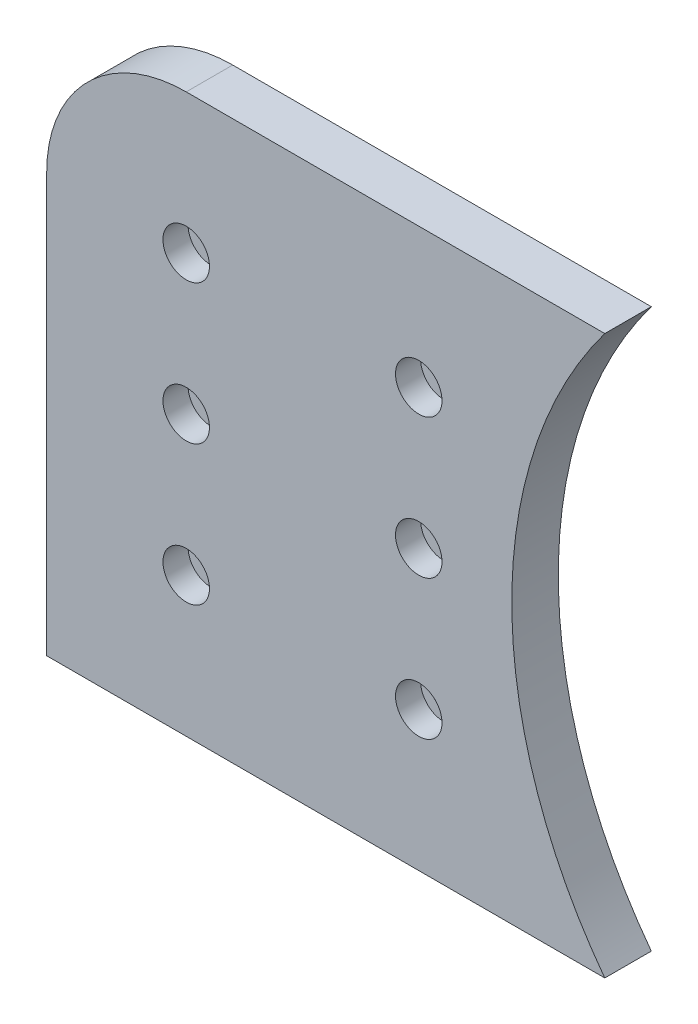
ISO-10303-21;
HEADER;
FILE_DESCRIPTION(('STEP AP214'),'2;1');
FILE_NAME('part.step','',(''),(''),'','','');
FILE_SCHEMA(('AUTOMOTIVE_DESIGN { 1 0 10303 214 1 1 1 1 }'));
ENDSEC;
DATA;
#1=APPLICATION_CONTEXT('core data for automotive mechanical design processes');
#2=APPLICATION_PROTOCOL_DEFINITION('international standard','automotive_design',2000,#1);
#3=PRODUCT_CONTEXT('',#1,'mechanical');
#4=PRODUCT('Part','Part','',(#3));
#5=PRODUCT_RELATED_PRODUCT_CATEGORY('part','',(#4));
#6=PRODUCT_DEFINITION_FORMATION('','',#4);
#7=PRODUCT_DEFINITION_CONTEXT('part definition',#1,'design');
#8=PRODUCT_DEFINITION('design','',#6,#7);
#9=PRODUCT_DEFINITION_SHAPE('','',#8);
#10=(LENGTH_UNIT() NAMED_UNIT(*) SI_UNIT(.MILLI.,.METRE.));
#11=(NAMED_UNIT(*) PLANE_ANGLE_UNIT() SI_UNIT($,.RADIAN.));
#12=(NAMED_UNIT(*) SI_UNIT($,.STERADIAN.) SOLID_ANGLE_UNIT());
#13=UNCERTAINTY_MEASURE_WITH_UNIT(LENGTH_MEASURE(1.E-05),#10,'distance_accuracy_value','');
#14=(GEOMETRIC_REPRESENTATION_CONTEXT(3) GLOBAL_UNCERTAINTY_ASSIGNED_CONTEXT((#13)) GLOBAL_UNIT_ASSIGNED_CONTEXT((#10,
#11,#12)) REPRESENTATION_CONTEXT('',''));
#15=CARTESIAN_POINT('',(0.,0.,0.));
#16=DIRECTION('',(0.,0.,1.));
#17=DIRECTION('',(1.,0.,0.));
#18=AXIS2_PLACEMENT_3D('',#15,#16,#17);
#19=CARTESIAN_POINT('',(200.,0.,5.));
#20=DIRECTION('',(0.,0.,-1.));
#21=DIRECTION('',(1.,0.,0.));
#22=AXIS2_PLACEMENT_3D('',#19,#20,#21);
#23=CYLINDRICAL_SURFACE('',#22,100.);
#24=CARTESIAN_POINT('',(200.,0.,-5.));
#25=DIRECTION('',(0.,0.,1.));
#26=DIRECTION('',(1.,0.,0.));
#27=AXIS2_PLACEMENT_3D('',#24,#25,#26);
#28=CIRCLE('',#27,100.);
#29=CARTESIAN_POINT('',(120.,60.,-5.));
#30=VERTEX_POINT('',#29);
#31=CARTESIAN_POINT('',(120.,-60.,-5.));
#32=VERTEX_POINT('',#31);
#33=EDGE_CURVE('E115',#30,#32,#28,.T.);
#34=ORIENTED_EDGE('',*,*,#33,.F.);
#35=DIRECTION('',(0.,0.,-1.));
#36=VECTOR('',#35,1.);
#37=CARTESIAN_POINT('',(120.,60.,5.));
#38=LINE('',#37,#36);
#39=CARTESIAN_POINT('',(120.,60.,5.));
#40=VERTEX_POINT('',#39);
#41=EDGE_CURVE('E103',#40,#30,#38,.T.);
#42=ORIENTED_EDGE('',*,*,#41,.F.);
#43=CARTESIAN_POINT('',(200.,0.,5.));
#44=DIRECTION('',(0.,0.,1.));
#45=DIRECTION('',(1.,0.,0.));
#46=AXIS2_PLACEMENT_3D('',#43,#44,#45);
#47=CIRCLE('',#46,100.);
#48=CARTESIAN_POINT('',(120.,-60.,5.));
#49=VERTEX_POINT('',#48);
#50=EDGE_CURVE('E83',#40,#49,#47,.T.);
#51=ORIENTED_EDGE('',*,*,#50,.T.);
#52=DIRECTION('',(0.,0.,-1.));
#53=VECTOR('',#52,1.);
#54=CARTESIAN_POINT('',(120.,-60.,5.));
#55=LINE('',#54,#53);
#56=EDGE_CURVE('E92',#49,#32,#55,.T.);
#57=ORIENTED_EDGE('',*,*,#56,.T.);
#58=EDGE_LOOP('',(#34,#42,#51,#57));
#59=FACE_BOUND('',#58,.T.);
#60=ADVANCED_FACE('F32',(#59),#23,.F.);
#61=CARTESIAN_POINT('',(120.,-60.,5.));
#62=DIRECTION('',(0.,1.,0.));
#63=DIRECTION('',(0.,0.,1.));
#64=AXIS2_PLACEMENT_3D('',#61,#62,#63);
#65=PLANE('',#64);
#66=DIRECTION('',(-1.,0.,0.));
#67=VECTOR('',#66,1.);
#68=CARTESIAN_POINT('',(120.,-60.,-5.));
#69=LINE('',#68,#67);
#70=CARTESIAN_POINT('',(0.,-60.,-5.));
#71=VERTEX_POINT('',#70);
#72=EDGE_CURVE('E95',#32,#71,#69,.T.);
#73=ORIENTED_EDGE('',*,*,#72,.F.);
#74=ORIENTED_EDGE('',*,*,#56,.F.);
#75=DIRECTION('',(-1.,0.,0.));
#76=VECTOR('',#75,1.);
#77=CARTESIAN_POINT('',(120.,-60.,5.));
#78=LINE('',#77,#76);
#79=CARTESIAN_POINT('',(0.,-60.,5.));
#80=VERTEX_POINT('',#79);
#81=EDGE_CURVE('E78',#49,#80,#78,.T.);
#82=ORIENTED_EDGE('',*,*,#81,.T.);
#83=DIRECTION('',(0.,0.,-1.));
#84=VECTOR('',#83,1.);
#85=CARTESIAN_POINT('',(0.,-60.,5.));
#86=LINE('',#85,#84);
#87=EDGE_CURVE('E100',#80,#71,#86,.T.);
#88=ORIENTED_EDGE('',*,*,#87,.T.);
#89=EDGE_LOOP('',(#73,#74,#82,#88));
#90=FACE_BOUND('',#89,.T.);
#91=ADVANCED_FACE('F93',(#90),#65,.F.);
#92=CARTESIAN_POINT('',(0.,60.,5.));
#93=DIRECTION('',(1.,0.,0.));
#94=DIRECTION('',(0.,0.,1.));
#95=AXIS2_PLACEMENT_3D('',#92,#93,#94);
#96=PLANE('',#95);
#97=DIRECTION('',(0.,1.,0.));
#98=VECTOR('',#97,1.);
#99=CARTESIAN_POINT('',(0.,60.,-5.));
#100=LINE('',#99,#98);
#101=CARTESIAN_POINT('',(0.,30.,-5.));
#102=VERTEX_POINT('',#101);
#103=EDGE_CURVE('E106',#71,#102,#100,.T.);
#104=ORIENTED_EDGE('',*,*,#103,.F.);
#105=ORIENTED_EDGE('',*,*,#87,.F.);
#106=DIRECTION('',(0.,1.,0.));
#107=VECTOR('',#106,1.);
#108=CARTESIAN_POINT('',(0.,60.,5.));
#109=LINE('',#108,#107);
#110=CARTESIAN_POINT('',(0.,30.,5.));
#111=VERTEX_POINT('',#110);
#112=EDGE_CURVE('E86',#80,#111,#109,.T.);
#113=ORIENTED_EDGE('',*,*,#112,.T.);
#114=DIRECTION('',(0.,0.,-1.));
#115=VECTOR('',#114,1.);
#116=CARTESIAN_POINT('',(0.,30.,5.));
#117=LINE('',#116,#115);
#118=EDGE_CURVE('E124',#102,#111,#117,.F.);
#119=ORIENTED_EDGE('',*,*,#118,.F.);
#120=EDGE_LOOP('',(#104,#105,#113,#119));
#121=FACE_BOUND('',#120,.T.);
#122=ADVANCED_FACE('F187',(#121),#96,.F.);
#123=CARTESIAN_POINT('',(120.,60.,5.));
#124=DIRECTION('',(0.,-1.,0.));
#125=DIRECTION('',(0.,0.,-1.));
#126=AXIS2_PLACEMENT_3D('',#123,#124,#125);
#127=PLANE('',#126);
#128=DIRECTION('',(1.,0.,0.));
#129=VECTOR('',#128,1.);
#130=CARTESIAN_POINT('',(120.,60.,5.));
#131=LINE('',#130,#129);
#132=CARTESIAN_POINT('',(30.,60.,5.));
#133=VERTEX_POINT('',#132);
#134=EDGE_CURVE('E113',#133,#40,#131,.T.);
#135=ORIENTED_EDGE('',*,*,#134,.T.);
#136=ORIENTED_EDGE('',*,*,#41,.T.);
#137=DIRECTION('',(1.,0.,0.));
#138=VECTOR('',#137,1.);
#139=CARTESIAN_POINT('',(120.,60.,-5.));
#140=LINE('',#139,#138);
#141=CARTESIAN_POINT('',(30.,60.,-5.));
#142=VERTEX_POINT('',#141);
#143=EDGE_CURVE('E104',#142,#30,#140,.T.);
#144=ORIENTED_EDGE('',*,*,#143,.F.);
#145=DIRECTION('',(0.,0.,-1.));
#146=VECTOR('',#145,1.);
#147=CARTESIAN_POINT('',(30.,60.,5.));
#148=LINE('',#147,#146);
#149=EDGE_CURVE('E99',#133,#142,#148,.T.);
#150=ORIENTED_EDGE('',*,*,#149,.F.);
#151=EDGE_LOOP('',(#135,#136,#144,#150));
#152=FACE_BOUND('',#151,.T.);
#153=ADVANCED_FACE('F239',(#152),#127,.F.);
#154=CARTESIAN_POINT('',(200.,0.,5.));
#155=DIRECTION('',(0.,0.,-1.));
#156=DIRECTION('',(1.,0.,0.));
#157=AXIS2_PLACEMENT_3D('',#154,#155,#156);
#158=PLANE('',#157);
#159=CARTESIAN_POINT('',(30.,0.,5.));
#160=DIRECTION('',(0.,0.,-1.));
#161=DIRECTION('',(-1.,0.,0.));
#162=AXIS2_PLACEMENT_3D('',#159,#160,#161);
#163=CIRCLE('',#162,5.);
#164=CARTESIAN_POINT('',(25.,0.,5.));
#165=VERTEX_POINT('',#164);
#166=EDGE_CURVE('E470',#165,#165,#163,.T.);
#167=ORIENTED_EDGE('',*,*,#166,.T.);
#168=EDGE_LOOP('',(#167));
#169=FACE_BOUND('',#168,.T.);
#170=CARTESIAN_POINT('',(30.,30.,5.));
#171=DIRECTION('',(0.,0.,-1.));
#172=DIRECTION('',(-1.,0.,0.));
#173=AXIS2_PLACEMENT_3D('',#170,#171,#172);
#174=CIRCLE('',#173,5.);
#175=CARTESIAN_POINT('',(25.,30.,5.));
#176=VERTEX_POINT('',#175);
#177=EDGE_CURVE('E458',#176,#176,#174,.T.);
#178=ORIENTED_EDGE('',*,*,#177,.T.);
#179=EDGE_LOOP('',(#178));
#180=FACE_BOUND('',#179,.T.);
#181=ORIENTED_EDGE('',*,*,#112,.F.);
#182=ORIENTED_EDGE('',*,*,#81,.F.);
#183=ORIENTED_EDGE('',*,*,#50,.F.);
#184=ORIENTED_EDGE('',*,*,#134,.F.);
#185=CARTESIAN_POINT('',(30.,30.,5.));
#186=DIRECTION('',(0.,0.,1.));
#187=DIRECTION('',(1.,0.,0.));
#188=AXIS2_PLACEMENT_3D('',#185,#186,#187);
#189=CIRCLE('',#188,30.);
#190=EDGE_CURVE('E47',#111,#133,#189,.F.);
#191=ORIENTED_EDGE('',*,*,#190,.F.);
#192=EDGE_LOOP('',(#181,#182,#183,#184,#191));
#193=FACE_BOUND('',#192,.T.);
#194=CARTESIAN_POINT('',(30.,-30.,5.));
#195=DIRECTION('',(0.,0.,-1.));
#196=DIRECTION('',(-1.,0.,0.));
#197=AXIS2_PLACEMENT_3D('',#194,#195,#196);
#198=CIRCLE('',#197,5.);
#199=CARTESIAN_POINT('',(25.,-30.,5.));
#200=VERTEX_POINT('',#199);
#201=EDGE_CURVE('E127',#200,#200,#198,.T.);
#202=ORIENTED_EDGE('',*,*,#201,.T.);
#203=EDGE_LOOP('',(#202));
#204=FACE_BOUND('',#203,.T.);
#205=CARTESIAN_POINT('',(80.,30.,5.));
#206=DIRECTION('',(0.,0.,-1.));
#207=DIRECTION('',(-1.,0.,0.));
#208=AXIS2_PLACEMENT_3D('',#205,#206,#207);
#209=CIRCLE('',#208,5.);
#210=CARTESIAN_POINT('',(75.,30.,5.));
#211=VERTEX_POINT('',#210);
#212=EDGE_CURVE('E139',#211,#211,#209,.T.);
#213=ORIENTED_EDGE('',*,*,#212,.T.);
#214=EDGE_LOOP('',(#213));
#215=FACE_BOUND('',#214,.T.);
#216=CARTESIAN_POINT('',(80.,0.,5.));
#217=DIRECTION('',(0.,0.,-1.));
#218=DIRECTION('',(-1.,0.,0.));
#219=AXIS2_PLACEMENT_3D('',#216,#217,#218);
#220=CIRCLE('',#219,5.);
#221=CARTESIAN_POINT('',(75.,0.,5.));
#222=VERTEX_POINT('',#221);
#223=EDGE_CURVE('E151',#222,#222,#220,.T.);
#224=ORIENTED_EDGE('',*,*,#223,.T.);
#225=EDGE_LOOP('',(#224));
#226=FACE_BOUND('',#225,.T.);
#227=CARTESIAN_POINT('',(80.,-30.,5.));
#228=DIRECTION('',(0.,0.,-1.));
#229=DIRECTION('',(-1.,0.,0.));
#230=AXIS2_PLACEMENT_3D('',#227,#228,#229);
#231=CIRCLE('',#230,5.);
#232=CARTESIAN_POINT('',(75.,-30.,5.));
#233=VERTEX_POINT('',#232);
#234=EDGE_CURVE('E163',#233,#233,#231,.T.);
#235=ORIENTED_EDGE('',*,*,#234,.T.);
#236=EDGE_LOOP('',(#235));
#237=FACE_BOUND('',#236,.T.);
#238=ADVANCED_FACE('F80',(#169,#180,#193,#204,#215,#226,#237),#158,.F.);
#239=CARTESIAN_POINT('',(200.,0.,-5.));
#240=DIRECTION('',(0.,0.,-1.));
#241=DIRECTION('',(1.,0.,0.));
#242=AXIS2_PLACEMENT_3D('',#239,#240,#241);
#243=PLANE('',#242);
#244=CARTESIAN_POINT('',(30.,0.,-5.));
#245=DIRECTION('',(0.,0.,-1.));
#246=DIRECTION('',(-1.,0.,0.));
#247=AXIS2_PLACEMENT_3D('',#244,#245,#246);
#248=CIRCLE('',#247,2.65);
#249=CARTESIAN_POINT('',(27.35,0.,-5.));
#250=VERTEX_POINT('',#249);
#251=EDGE_CURVE('E450',#250,#250,#248,.T.);
#252=ORIENTED_EDGE('',*,*,#251,.F.);
#253=EDGE_LOOP('',(#252));
#254=FACE_BOUND('',#253,.T.);
#255=CARTESIAN_POINT('',(30.,30.,-5.));
#256=DIRECTION('',(0.,0.,-1.));
#257=DIRECTION('',(-1.,0.,0.));
#258=AXIS2_PLACEMENT_3D('',#255,#256,#257);
#259=CIRCLE('',#258,2.65);
#260=CARTESIAN_POINT('',(27.35,30.,-5.));
#261=VERTEX_POINT('',#260);
#262=EDGE_CURVE('E109',#261,#261,#259,.T.);
#263=ORIENTED_EDGE('',*,*,#262,.F.);
#264=EDGE_LOOP('',(#263));
#265=FACE_BOUND('',#264,.T.);
#266=ORIENTED_EDGE('',*,*,#143,.T.);
#267=ORIENTED_EDGE('',*,*,#33,.T.);
#268=ORIENTED_EDGE('',*,*,#72,.T.);
#269=ORIENTED_EDGE('',*,*,#103,.T.);
#270=CARTESIAN_POINT('',(30.,30.,-5.));
#271=DIRECTION('',(0.,0.,1.));
#272=DIRECTION('',(1.,0.,0.));
#273=AXIS2_PLACEMENT_3D('',#270,#271,#272);
#274=CIRCLE('',#273,30.);
#275=EDGE_CURVE('E54',#142,#102,#274,.T.);
#276=ORIENTED_EDGE('',*,*,#275,.F.);
#277=EDGE_LOOP('',(#266,#267,#268,#269,#276));
#278=FACE_BOUND('',#277,.T.);
#279=CARTESIAN_POINT('',(30.,-30.,-5.));
#280=DIRECTION('',(0.,0.,-1.));
#281=DIRECTION('',(-1.,0.,0.));
#282=AXIS2_PLACEMENT_3D('',#279,#280,#281);
#283=CIRCLE('',#282,2.65);
#284=CARTESIAN_POINT('',(27.35,-30.,-5.));
#285=VERTEX_POINT('',#284);
#286=EDGE_CURVE('E130',#285,#285,#283,.T.);
#287=ORIENTED_EDGE('',*,*,#286,.F.);
#288=EDGE_LOOP('',(#287));
#289=FACE_BOUND('',#288,.T.);
#290=CARTESIAN_POINT('',(80.,30.,-5.));
#291=DIRECTION('',(0.,0.,-1.));
#292=DIRECTION('',(-1.,0.,0.));
#293=AXIS2_PLACEMENT_3D('',#290,#291,#292);
#294=CIRCLE('',#293,2.65);
#295=CARTESIAN_POINT('',(77.35,30.,-5.));
#296=VERTEX_POINT('',#295);
#297=EDGE_CURVE('E142',#296,#296,#294,.T.);
#298=ORIENTED_EDGE('',*,*,#297,.F.);
#299=EDGE_LOOP('',(#298));
#300=FACE_BOUND('',#299,.T.);
#301=CARTESIAN_POINT('',(80.,0.,-5.));
#302=DIRECTION('',(0.,0.,-1.));
#303=DIRECTION('',(-1.,0.,0.));
#304=AXIS2_PLACEMENT_3D('',#301,#302,#303);
#305=CIRCLE('',#304,2.65);
#306=CARTESIAN_POINT('',(77.35,0.,-5.));
#307=VERTEX_POINT('',#306);
#308=EDGE_CURVE('E154',#307,#307,#305,.T.);
#309=ORIENTED_EDGE('',*,*,#308,.F.);
#310=EDGE_LOOP('',(#309));
#311=FACE_BOUND('',#310,.T.);
#312=CARTESIAN_POINT('',(80.,-30.,-5.));
#313=DIRECTION('',(0.,0.,-1.));
#314=DIRECTION('',(-1.,0.,0.));
#315=AXIS2_PLACEMENT_3D('',#312,#313,#314);
#316=CIRCLE('',#315,2.65);
#317=CARTESIAN_POINT('',(77.35,-30.,-5.));
#318=VERTEX_POINT('',#317);
#319=EDGE_CURVE('E166',#318,#318,#316,.T.);
#320=ORIENTED_EDGE('',*,*,#319,.F.);
#321=EDGE_LOOP('',(#320));
#322=FACE_BOUND('',#321,.T.);
#323=ADVANCED_FACE('F195',(#254,#265,#278,#289,#300,#311,#322),#243,.T.);
#324=CARTESIAN_POINT('',(30.,30.,5.));
#325=DIRECTION('',(0.,0.,-1.));
#326=DIRECTION('',(1.,0.,0.));
#327=AXIS2_PLACEMENT_3D('',#324,#325,#326);
#328=CYLINDRICAL_SURFACE('',#327,30.);
#329=ORIENTED_EDGE('',*,*,#190,.T.);
#330=ORIENTED_EDGE('',*,*,#149,.T.);
#331=ORIENTED_EDGE('',*,*,#275,.T.);
#332=ORIENTED_EDGE('',*,*,#118,.T.);
#333=EDGE_LOOP('',(#329,#330,#331,#332));
#334=FACE_BOUND('',#333,.T.);
#335=ADVANCED_FACE('F191',(#334),#328,.T.);
#336=CARTESIAN_POINT('',(30.,30.,5.));
#337=DIRECTION('',(0.,0.,1.));
#338=DIRECTION('',(-1.,0.,0.));
#339=AXIS2_PLACEMENT_3D('',#336,#337,#338);
#340=CYLINDRICAL_SURFACE('',#339,2.65);
#341=ORIENTED_EDGE('',*,*,#262,.T.);
#342=EDGE_LOOP('',(#341));
#343=FACE_BOUND('',#342,.T.);
#344=CARTESIAN_POINT('',(30.,30.,-0.4));
#345=DIRECTION('',(0.,0.,-1.));
#346=DIRECTION('',(-1.,0.,0.));
#347=AXIS2_PLACEMENT_3D('',#344,#345,#346);
#348=CIRCLE('',#347,2.65);
#349=CARTESIAN_POINT('',(27.35,30.,-0.4));
#350=VERTEX_POINT('',#349);
#351=EDGE_CURVE('E453',#350,#350,#348,.T.);
#352=ORIENTED_EDGE('',*,*,#351,.F.);
#353=EDGE_LOOP('',(#352));
#354=FACE_BOUND('',#353,.T.);
#355=ADVANCED_FACE('F194',(#343,#354),#340,.F.);
#356=CARTESIAN_POINT('',(27.35,30.,-0.4));
#357=DIRECTION('',(0.,0.,-1.));
#358=DIRECTION('',(1.,0.,0.));
#359=AXIS2_PLACEMENT_3D('',#356,#357,#358);
#360=PLANE('',#359);
#361=ORIENTED_EDGE('',*,*,#351,.T.);
#362=EDGE_LOOP('',(#361));
#363=FACE_BOUND('',#362,.T.);
#364=CARTESIAN_POINT('',(30.,30.,-0.4));
#365=DIRECTION('',(0.,0.,-1.));
#366=DIRECTION('',(-1.,0.,0.));
#367=AXIS2_PLACEMENT_3D('',#364,#365,#366);
#368=CIRCLE('',#367,5.);
#369=CARTESIAN_POINT('',(25.,30.,-0.4));
#370=VERTEX_POINT('',#369);
#371=EDGE_CURVE('E455',#370,#370,#368,.T.);
#372=ORIENTED_EDGE('',*,*,#371,.F.);
#373=EDGE_LOOP('',(#372));
#374=FACE_BOUND('',#373,.T.);
#375=ADVANCED_FACE('F341',(#363,#374),#360,.F.);
#376=CARTESIAN_POINT('',(30.,30.,5.));
#377=DIRECTION('',(0.,0.,1.));
#378=DIRECTION('',(-1.,0.,0.));
#379=AXIS2_PLACEMENT_3D('',#376,#377,#378);
#380=CYLINDRICAL_SURFACE('',#379,5.);
#381=ORIENTED_EDGE('',*,*,#371,.T.);
#382=EDGE_LOOP('',(#381));
#383=FACE_BOUND('',#382,.T.);
#384=ORIENTED_EDGE('',*,*,#177,.F.);
#385=EDGE_LOOP('',(#384));
#386=FACE_BOUND('',#385,.T.);
#387=ADVANCED_FACE('F332',(#383,#386),#380,.F.);
#388=CARTESIAN_POINT('',(30.,0.,5.));
#389=DIRECTION('',(0.,0.,1.));
#390=DIRECTION('',(-1.,0.,0.));
#391=AXIS2_PLACEMENT_3D('',#388,#389,#390);
#392=CYLINDRICAL_SURFACE('',#391,2.65);
#393=ORIENTED_EDGE('',*,*,#251,.T.);
#394=EDGE_LOOP('',(#393));
#395=FACE_BOUND('',#394,.T.);
#396=CARTESIAN_POINT('',(30.,0.,-0.4));
#397=DIRECTION('',(0.,0.,-1.));
#398=DIRECTION('',(-1.,0.,0.));
#399=AXIS2_PLACEMENT_3D('',#396,#397,#398);
#400=CIRCLE('',#399,2.65);
#401=CARTESIAN_POINT('',(27.35,0.,-0.4));
#402=VERTEX_POINT('',#401);
#403=EDGE_CURVE('E463',#402,#402,#400,.T.);
#404=ORIENTED_EDGE('',*,*,#403,.F.);
#405=EDGE_LOOP('',(#404));
#406=FACE_BOUND('',#405,.T.);
#407=ADVANCED_FACE('F323',(#395,#406),#392,.F.);
#408=CARTESIAN_POINT('',(27.35,0.,-0.4));
#409=DIRECTION('',(0.,0.,-1.));
#410=DIRECTION('',(1.,0.,0.));
#411=AXIS2_PLACEMENT_3D('',#408,#409,#410);
#412=PLANE('',#411);
#413=ORIENTED_EDGE('',*,*,#403,.T.);
#414=EDGE_LOOP('',(#413));
#415=FACE_BOUND('',#414,.T.);
#416=CARTESIAN_POINT('',(30.,0.,-0.4));
#417=DIRECTION('',(0.,0.,-1.));
#418=DIRECTION('',(-1.,0.,0.));
#419=AXIS2_PLACEMENT_3D('',#416,#417,#418);
#420=CIRCLE('',#419,5.);
#421=CARTESIAN_POINT('',(25.,0.,-0.4));
#422=VERTEX_POINT('',#421);
#423=EDGE_CURVE('E466',#422,#422,#420,.T.);
#424=ORIENTED_EDGE('',*,*,#423,.F.);
#425=EDGE_LOOP('',(#424));
#426=FACE_BOUND('',#425,.T.);
#427=ADVANCED_FACE('F314',(#415,#426),#412,.F.);
#428=CARTESIAN_POINT('',(30.,0.,5.));
#429=DIRECTION('',(0.,0.,1.));
#430=DIRECTION('',(-1.,0.,0.));
#431=AXIS2_PLACEMENT_3D('',#428,#429,#430);
#432=CYLINDRICAL_SURFACE('',#431,5.);
#433=ORIENTED_EDGE('',*,*,#423,.T.);
#434=EDGE_LOOP('',(#433));
#435=FACE_BOUND('',#434,.T.);
#436=ORIENTED_EDGE('',*,*,#166,.F.);
#437=EDGE_LOOP('',(#436));
#438=FACE_BOUND('',#437,.T.);
#439=ADVANCED_FACE('F208',(#435,#438),#432,.F.);
#440=CARTESIAN_POINT('',(30.,-30.,5.));
#441=DIRECTION('',(0.,0.,1.));
#442=DIRECTION('',(-1.,0.,0.));
#443=AXIS2_PLACEMENT_3D('',#440,#441,#442);
#444=CYLINDRICAL_SURFACE('',#443,5.);
#445=CARTESIAN_POINT('',(30.,-30.,-0.4));
#446=DIRECTION('',(0.,0.,-1.));
#447=DIRECTION('',(-1.,0.,0.));
#448=AXIS2_PLACEMENT_3D('',#445,#446,#447);
#449=CIRCLE('',#448,5.);
#450=CARTESIAN_POINT('',(25.,-30.,-0.4));
#451=VERTEX_POINT('',#450);
#452=EDGE_CURVE('E136',#451,#451,#449,.T.);
#453=ORIENTED_EDGE('',*,*,#452,.T.);
#454=EDGE_LOOP('',(#453));
#455=FACE_BOUND('',#454,.T.);
#456=ORIENTED_EDGE('',*,*,#201,.F.);
#457=EDGE_LOOP('',(#456));
#458=FACE_BOUND('',#457,.T.);
#459=ADVANCED_FACE('F204',(#455,#458),#444,.F.);
#460=CARTESIAN_POINT('',(27.35,-30.,-0.4));
#461=DIRECTION('',(0.,0.,-1.));
#462=DIRECTION('',(1.,0.,0.));
#463=AXIS2_PLACEMENT_3D('',#460,#461,#462);
#464=PLANE('',#463);
#465=CARTESIAN_POINT('',(30.,-30.,-0.4));
#466=DIRECTION('',(0.,0.,-1.));
#467=DIRECTION('',(-1.,0.,0.));
#468=AXIS2_PLACEMENT_3D('',#465,#466,#467);
#469=CIRCLE('',#468,2.65);
#470=CARTESIAN_POINT('',(27.35,-30.,-0.4));
#471=VERTEX_POINT('',#470);
#472=EDGE_CURVE('E133',#471,#471,#469,.T.);
#473=ORIENTED_EDGE('',*,*,#472,.T.);
#474=EDGE_LOOP('',(#473));
#475=FACE_BOUND('',#474,.T.);
#476=ORIENTED_EDGE('',*,*,#452,.F.);
#477=EDGE_LOOP('',(#476));
#478=FACE_BOUND('',#477,.T.);
#479=ADVANCED_FACE('F200',(#475,#478),#464,.F.);
#480=CARTESIAN_POINT('',(30.,-30.,5.));
#481=DIRECTION('',(0.,0.,1.));
#482=DIRECTION('',(-1.,0.,0.));
#483=AXIS2_PLACEMENT_3D('',#480,#481,#482);
#484=CYLINDRICAL_SURFACE('',#483,2.65);
#485=ORIENTED_EDGE('',*,*,#286,.T.);
#486=EDGE_LOOP('',(#485));
#487=FACE_BOUND('',#486,.T.);
#488=ORIENTED_EDGE('',*,*,#472,.F.);
#489=EDGE_LOOP('',(#488));
#490=FACE_BOUND('',#489,.T.);
#491=ADVANCED_FACE('F196',(#487,#490),#484,.F.);
#492=CARTESIAN_POINT('',(80.,30.,5.));
#493=DIRECTION('',(0.,0.,1.));
#494=DIRECTION('',(-1.,0.,0.));
#495=AXIS2_PLACEMENT_3D('',#492,#493,#494);
#496=CYLINDRICAL_SURFACE('',#495,5.);
#497=CARTESIAN_POINT('',(80.,30.,-0.4));
#498=DIRECTION('',(0.,0.,-1.));
#499=DIRECTION('',(-1.,0.,0.));
#500=AXIS2_PLACEMENT_3D('',#497,#498,#499);
#501=CIRCLE('',#500,5.);
#502=CARTESIAN_POINT('',(75.,30.,-0.4));
#503=VERTEX_POINT('',#502);
#504=EDGE_CURVE('E148',#503,#503,#501,.T.);
#505=ORIENTED_EDGE('',*,*,#504,.T.);
#506=EDGE_LOOP('',(#505));
#507=FACE_BOUND('',#506,.T.);
#508=ORIENTED_EDGE('',*,*,#212,.F.);
#509=EDGE_LOOP('',(#508));
#510=FACE_BOUND('',#509,.T.);
#511=ADVANCED_FACE('F199',(#507,#510),#496,.F.);
#512=CARTESIAN_POINT('',(77.35,30.,-0.4));
#513=DIRECTION('',(0.,0.,-1.));
#514=DIRECTION('',(1.,0.,0.));
#515=AXIS2_PLACEMENT_3D('',#512,#513,#514);
#516=PLANE('',#515);
#517=CARTESIAN_POINT('',(80.,30.,-0.4));
#518=DIRECTION('',(0.,0.,-1.));
#519=DIRECTION('',(-1.,0.,0.));
#520=AXIS2_PLACEMENT_3D('',#517,#518,#519);
#521=CIRCLE('',#520,2.65);
#522=CARTESIAN_POINT('',(77.35,30.,-0.4));
#523=VERTEX_POINT('',#522);
#524=EDGE_CURVE('E145',#523,#523,#521,.T.);
#525=ORIENTED_EDGE('',*,*,#524,.T.);
#526=EDGE_LOOP('',(#525));
#527=FACE_BOUND('',#526,.T.);
#528=ORIENTED_EDGE('',*,*,#504,.F.);
#529=EDGE_LOOP('',(#528));
#530=FACE_BOUND('',#529,.T.);
#531=ADVANCED_FACE('F214',(#527,#530),#516,.F.);
#532=CARTESIAN_POINT('',(80.,30.,5.));
#533=DIRECTION('',(0.,0.,1.));
#534=DIRECTION('',(-1.,0.,0.));
#535=AXIS2_PLACEMENT_3D('',#532,#533,#534);
#536=CYLINDRICAL_SURFACE('',#535,2.65);
#537=ORIENTED_EDGE('',*,*,#297,.T.);
#538=EDGE_LOOP('',(#537));
#539=FACE_BOUND('',#538,.T.);
#540=ORIENTED_EDGE('',*,*,#524,.F.);
#541=EDGE_LOOP('',(#540));
#542=FACE_BOUND('',#541,.T.);
#543=ADVANCED_FACE('F210',(#539,#542),#536,.F.);
#544=CARTESIAN_POINT('',(80.,0.,5.));
#545=DIRECTION('',(0.,0.,1.));
#546=DIRECTION('',(-1.,0.,0.));
#547=AXIS2_PLACEMENT_3D('',#544,#545,#546);
#548=CYLINDRICAL_SURFACE('',#547,5.);
#549=CARTESIAN_POINT('',(80.,0.,-0.4));
#550=DIRECTION('',(0.,0.,-1.));
#551=DIRECTION('',(-1.,0.,0.));
#552=AXIS2_PLACEMENT_3D('',#549,#550,#551);
#553=CIRCLE('',#552,5.);
#554=CARTESIAN_POINT('',(75.,0.,-0.4));
#555=VERTEX_POINT('',#554);
#556=EDGE_CURVE('E160',#555,#555,#553,.T.);
#557=ORIENTED_EDGE('',*,*,#556,.T.);
#558=EDGE_LOOP('',(#557));
#559=FACE_BOUND('',#558,.T.);
#560=ORIENTED_EDGE('',*,*,#223,.F.);
#561=EDGE_LOOP('',(#560));
#562=FACE_BOUND('',#561,.T.);
#563=ADVANCED_FACE('F213',(#559,#562),#548,.F.);
#564=CARTESIAN_POINT('',(77.35,0.,-0.4));
#565=DIRECTION('',(0.,0.,-1.));
#566=DIRECTION('',(1.,0.,0.));
#567=AXIS2_PLACEMENT_3D('',#564,#565,#566);
#568=PLANE('',#567);
#569=CARTESIAN_POINT('',(80.,0.,-0.4));
#570=DIRECTION('',(0.,0.,-1.));
#571=DIRECTION('',(-1.,0.,0.));
#572=AXIS2_PLACEMENT_3D('',#569,#570,#571);
#573=CIRCLE('',#572,2.65);
#574=CARTESIAN_POINT('',(77.35,0.,-0.4));
#575=VERTEX_POINT('',#574);
#576=EDGE_CURVE('E157',#575,#575,#573,.T.);
#577=ORIENTED_EDGE('',*,*,#576,.T.);
#578=EDGE_LOOP('',(#577));
#579=FACE_BOUND('',#578,.T.);
#580=ORIENTED_EDGE('',*,*,#556,.F.);
#581=EDGE_LOOP('',(#580));
#582=FACE_BOUND('',#581,.T.);
#583=ADVANCED_FACE('F225',(#579,#582),#568,.F.);
#584=CARTESIAN_POINT('',(80.,0.,5.));
#585=DIRECTION('',(0.,0.,1.));
#586=DIRECTION('',(-1.,0.,0.));
#587=AXIS2_PLACEMENT_3D('',#584,#585,#586);
#588=CYLINDRICAL_SURFACE('',#587,2.65);
#589=ORIENTED_EDGE('',*,*,#308,.T.);
#590=EDGE_LOOP('',(#589));
#591=FACE_BOUND('',#590,.T.);
#592=ORIENTED_EDGE('',*,*,#576,.F.);
#593=EDGE_LOOP('',(#592));
#594=FACE_BOUND('',#593,.T.);
#595=ADVANCED_FACE('F222',(#591,#594),#588,.F.);
#596=CARTESIAN_POINT('',(80.,-30.,5.));
#597=DIRECTION('',(0.,0.,1.));
#598=DIRECTION('',(-1.,0.,0.));
#599=AXIS2_PLACEMENT_3D('',#596,#597,#598);
#600=CYLINDRICAL_SURFACE('',#599,5.);
#601=CARTESIAN_POINT('',(80.,-30.,-0.4));
#602=DIRECTION('',(0.,0.,-1.));
#603=DIRECTION('',(-1.,0.,0.));
#604=AXIS2_PLACEMENT_3D('',#601,#602,#603);
#605=CIRCLE('',#604,5.);
#606=CARTESIAN_POINT('',(75.,-30.,-0.4));
#607=VERTEX_POINT('',#606);
#608=EDGE_CURVE('E11',#607,#607,#605,.T.);
#609=ORIENTED_EDGE('',*,*,#608,.T.);
#610=EDGE_LOOP('',(#609));
#611=FACE_BOUND('',#610,.T.);
#612=ORIENTED_EDGE('',*,*,#234,.F.);
#613=EDGE_LOOP('',(#612));
#614=FACE_BOUND('',#613,.T.);
#615=ADVANCED_FACE('F34',(#611,#614),#600,.F.);
#616=CARTESIAN_POINT('',(77.35,-30.,-0.4));
#617=DIRECTION('',(0.,0.,-1.));
#618=DIRECTION('',(1.,0.,0.));
#619=AXIS2_PLACEMENT_3D('',#616,#617,#618);
#620=PLANE('',#619);
#621=CARTESIAN_POINT('',(80.,-30.,-0.4));
#622=DIRECTION('',(0.,0.,-1.));
#623=DIRECTION('',(-1.,0.,0.));
#624=AXIS2_PLACEMENT_3D('',#621,#622,#623);
#625=CIRCLE('',#624,2.65);
#626=CARTESIAN_POINT('',(77.35,-30.,-0.4));
#627=VERTEX_POINT('',#626);
#628=EDGE_CURVE('E40',#627,#627,#625,.T.);
#629=ORIENTED_EDGE('',*,*,#628,.T.);
#630=EDGE_LOOP('',(#629));
#631=FACE_BOUND('',#630,.T.);
#632=ORIENTED_EDGE('',*,*,#608,.F.);
#633=EDGE_LOOP('',(#632));
#634=FACE_BOUND('',#633,.T.);
#635=ADVANCED_FACE('F171',(#631,#634),#620,.F.);
#636=CARTESIAN_POINT('',(80.,-30.,5.));
#637=DIRECTION('',(0.,0.,1.));
#638=DIRECTION('',(-1.,0.,0.));
#639=AXIS2_PLACEMENT_3D('',#636,#637,#638);
#640=CYLINDRICAL_SURFACE('',#639,2.65);
#641=ORIENTED_EDGE('',*,*,#319,.T.);
#642=EDGE_LOOP('',(#641));
#643=FACE_BOUND('',#642,.T.);
#644=ORIENTED_EDGE('',*,*,#628,.F.);
#645=EDGE_LOOP('',(#644));
#646=FACE_BOUND('',#645,.T.);
#647=ADVANCED_FACE('F174',(#643,#646),#640,.F.);
#648=CLOSED_SHELL('',(#60,#91,#122,#153,#238,#323,#335,#355,#375,#387,#407,#427,#439,#459,#479,
#491,#511,#531,#543,#563,#583,#595,#615,#635,#647));
#649=MANIFOLD_SOLID_BREP('B2',#648);
#650=ADVANCED_BREP_SHAPE_REPRESENTATION('',(#18,#649),#14);
#651=SHAPE_DEFINITION_REPRESENTATION(#9,#650);
ENDSEC;
END-ISO-10303-21;
